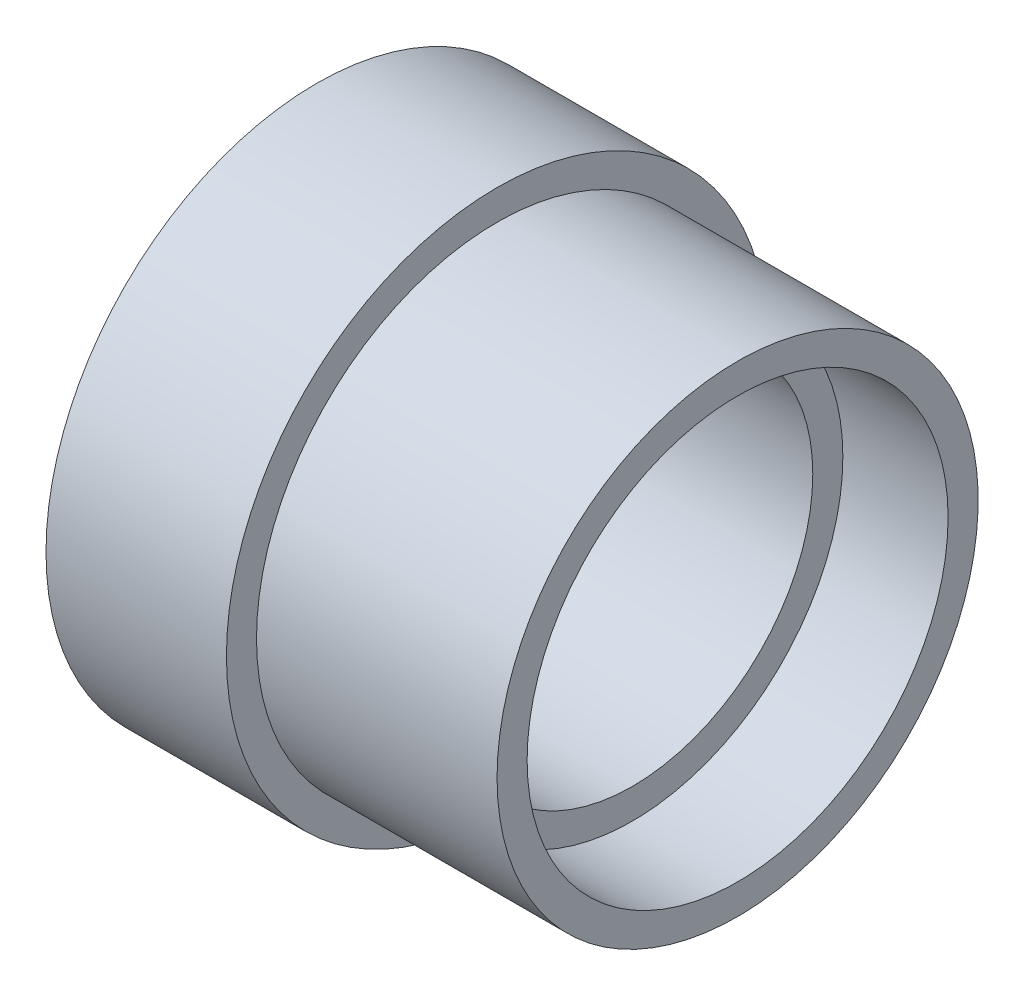
ISO-10303-21;
HEADER;
FILE_DESCRIPTION(('STEP AP214'),'2;1');
FILE_NAME('part.step','',(''),(''),'','','');
FILE_SCHEMA(('AUTOMOTIVE_DESIGN { 1 0 10303 214 1 1 1 1 }'));
ENDSEC;
DATA;
#1=APPLICATION_CONTEXT('core data for automotive mechanical design processes');
#2=APPLICATION_PROTOCOL_DEFINITION('international standard','automotive_design',2000,#1);
#3=PRODUCT_CONTEXT('',#1,'mechanical');
#4=PRODUCT('Part','Part','',(#3));
#5=PRODUCT_RELATED_PRODUCT_CATEGORY('part','',(#4));
#6=PRODUCT_DEFINITION_FORMATION('','',#4);
#7=PRODUCT_DEFINITION_CONTEXT('part definition',#1,'design');
#8=PRODUCT_DEFINITION('design','',#6,#7);
#9=PRODUCT_DEFINITION_SHAPE('','',#8);
#10=(LENGTH_UNIT() NAMED_UNIT(*) SI_UNIT(.MILLI.,.METRE.));
#11=(NAMED_UNIT(*) PLANE_ANGLE_UNIT() SI_UNIT($,.RADIAN.));
#12=(NAMED_UNIT(*) SI_UNIT($,.STERADIAN.) SOLID_ANGLE_UNIT());
#13=UNCERTAINTY_MEASURE_WITH_UNIT(LENGTH_MEASURE(1.E-05),#10,'distance_accuracy_value','');
#14=(GEOMETRIC_REPRESENTATION_CONTEXT(3) GLOBAL_UNCERTAINTY_ASSIGNED_CONTEXT((#13)) GLOBAL_UNIT_ASSIGNED_CONTEXT((#10,
#11,#12)) REPRESENTATION_CONTEXT('',''));
#15=CARTESIAN_POINT('',(0.,0.,0.));
#16=DIRECTION('',(0.,0.,1.));
#17=DIRECTION('',(1.,0.,0.));
#18=AXIS2_PLACEMENT_3D('',#15,#16,#17);
#19=CARTESIAN_POINT('',(-1017.,-156.,0.));
#20=DIRECTION('',(-1.,0.,0.));
#21=DIRECTION('',(0.,0.,1.));
#22=AXIS2_PLACEMENT_3D('',#19,#20,#21);
#23=CYLINDRICAL_SURFACE('',#22,14.);
#24=CARTESIAN_POINT('',(-2.99999999999989,-156.,0.));
#25=DIRECTION('',(-1.,0.,0.));
#26=DIRECTION('',(0.,0.,1.));
#27=AXIS2_PLACEMENT_3D('',#24,#25,#26);
#28=CIRCLE('',#27,14.);
#29=CARTESIAN_POINT('',(-2.99999999999989,-156.,14.));
#30=VERTEX_POINT('',#29);
#31=EDGE_CURVE('E10',#30,#30,#28,.T.);
#32=ORIENTED_EDGE('',*,*,#31,.F.);
#33=EDGE_LOOP('',(#32));
#34=FACE_BOUND('',#33,.T.);
#35=CARTESIAN_POINT('',(-10.,-156.,0.));
#36=DIRECTION('',(-1.,0.,0.));
#37=DIRECTION('',(0.,0.,1.));
#38=AXIS2_PLACEMENT_3D('',#35,#36,#37);
#39=CIRCLE('',#38,14.);
#40=CARTESIAN_POINT('',(-10.,-156.,14.));
#41=VERTEX_POINT('',#40);
#42=EDGE_CURVE('E66',#41,#41,#39,.T.);
#43=ORIENTED_EDGE('',*,*,#42,.T.);
#44=EDGE_LOOP('',(#43));
#45=FACE_BOUND('',#44,.T.);
#46=ADVANCED_FACE('F32',(#34,#45),#23,.F.);
#47=CARTESIAN_POINT('',(-2.99999999999997,-142.,0.));
#48=DIRECTION('',(-1.,0.,0.));
#49=DIRECTION('',(0.,0.,1.));
#50=AXIS2_PLACEMENT_3D('',#47,#48,#49);
#51=PLANE('',#50);
#52=CARTESIAN_POINT('',(-2.99999999999989,-156.,0.));
#53=DIRECTION('',(-1.,0.,0.));
#54=DIRECTION('',(0.,0.,1.));
#55=AXIS2_PLACEMENT_3D('',#52,#53,#54);
#56=CIRCLE('',#55,16.);
#57=CARTESIAN_POINT('',(-2.99999999999989,-156.,16.));
#58=VERTEX_POINT('',#57);
#59=EDGE_CURVE('E38',#58,#58,#56,.T.);
#60=ORIENTED_EDGE('',*,*,#59,.F.);
#61=EDGE_LOOP('',(#60));
#62=FACE_BOUND('',#61,.T.);
#63=ORIENTED_EDGE('',*,*,#31,.T.);
#64=EDGE_LOOP('',(#63));
#65=FACE_BOUND('',#64,.T.);
#66=ADVANCED_FACE('F115',(#62,#65),#51,.F.);
#67=CARTESIAN_POINT('',(-1017.,-156.,0.));
#68=DIRECTION('',(-1.,0.,0.));
#69=DIRECTION('',(0.,0.,1.));
#70=AXIS2_PLACEMENT_3D('',#67,#68,#69);
#71=CYLINDRICAL_SURFACE('',#70,16.);
#72=CARTESIAN_POINT('',(-18.9999999999999,-156.,0.));
#73=DIRECTION('',(-1.,0.,0.));
#74=DIRECTION('',(0.,0.,1.));
#75=AXIS2_PLACEMENT_3D('',#72,#73,#74);
#76=CIRCLE('',#75,16.);
#77=CARTESIAN_POINT('',(-18.9999999999999,-156.,16.));
#78=VERTEX_POINT('',#77);
#79=EDGE_CURVE('E42',#78,#78,#76,.T.);
#80=ORIENTED_EDGE('',*,*,#79,.F.);
#81=EDGE_LOOP('',(#80));
#82=FACE_BOUND('',#81,.T.);
#83=ORIENTED_EDGE('',*,*,#59,.T.);
#84=EDGE_LOOP('',(#83));
#85=FACE_BOUND('',#84,.T.);
#86=ADVANCED_FACE('F110',(#82,#85),#71,.T.);
#87=CARTESIAN_POINT('',(-19.,-140.,0.));
#88=DIRECTION('',(-1.,0.,0.));
#89=DIRECTION('',(0.,0.,1.));
#90=AXIS2_PLACEMENT_3D('',#87,#88,#89);
#91=PLANE('',#90);
#92=CARTESIAN_POINT('',(-18.9999999999999,-156.,0.));
#93=DIRECTION('',(-1.,0.,0.));
#94=DIRECTION('',(0.,0.,1.));
#95=AXIS2_PLACEMENT_3D('',#92,#93,#94);
#96=CIRCLE('',#95,18.);
#97=CARTESIAN_POINT('',(-18.9999999999999,-156.,18.));
#98=VERTEX_POINT('',#97);
#99=EDGE_CURVE('E46',#98,#98,#96,.T.);
#100=ORIENTED_EDGE('',*,*,#99,.F.);
#101=EDGE_LOOP('',(#100));
#102=FACE_BOUND('',#101,.T.);
#103=ORIENTED_EDGE('',*,*,#79,.T.);
#104=EDGE_LOOP('',(#103));
#105=FACE_BOUND('',#104,.T.);
#106=ADVANCED_FACE('F104',(#102,#105),#91,.F.);
#107=CARTESIAN_POINT('',(-1017.,-156.,0.));
#108=DIRECTION('',(-1.,0.,0.));
#109=DIRECTION('',(0.,0.,1.));
#110=AXIS2_PLACEMENT_3D('',#107,#108,#109);
#111=CYLINDRICAL_SURFACE('',#110,18.);
#112=CARTESIAN_POINT('',(-30.9999999999999,-156.,0.));
#113=DIRECTION('',(-1.,0.,0.));
#114=DIRECTION('',(0.,0.,1.));
#115=AXIS2_PLACEMENT_3D('',#112,#113,#114);
#116=CIRCLE('',#115,18.);
#117=CARTESIAN_POINT('',(-30.9999999999999,-156.,18.));
#118=VERTEX_POINT('',#117);
#119=EDGE_CURVE('E51',#118,#118,#116,.T.);
#120=ORIENTED_EDGE('',*,*,#119,.F.);
#121=EDGE_LOOP('',(#120));
#122=FACE_BOUND('',#121,.T.);
#123=ORIENTED_EDGE('',*,*,#99,.T.);
#124=EDGE_LOOP('',(#123));
#125=FACE_BOUND('',#124,.T.);
#126=ADVANCED_FACE('F98',(#122,#125),#111,.T.);
#127=CARTESIAN_POINT('',(-31.,-138.,0.));
#128=DIRECTION('',(1.,0.,0.));
#129=DIRECTION('',(0.,0.,-1.));
#130=AXIS2_PLACEMENT_3D('',#127,#128,#129);
#131=PLANE('',#130);
#132=CARTESIAN_POINT('',(-30.9999999999999,-156.,0.));
#133=DIRECTION('',(-1.,0.,0.));
#134=DIRECTION('',(0.,0.,1.));
#135=AXIS2_PLACEMENT_3D('',#132,#133,#134);
#136=CIRCLE('',#135,14.);
#137=CARTESIAN_POINT('',(-30.9999999999999,-156.,14.));
#138=VERTEX_POINT('',#137);
#139=EDGE_CURVE('E54',#138,#138,#136,.T.);
#140=ORIENTED_EDGE('',*,*,#139,.F.);
#141=EDGE_LOOP('',(#140));
#142=FACE_BOUND('',#141,.T.);
#143=ORIENTED_EDGE('',*,*,#119,.T.);
#144=EDGE_LOOP('',(#143));
#145=FACE_BOUND('',#144,.T.);
#146=ADVANCED_FACE('F92',(#142,#145),#131,.F.);
#147=CARTESIAN_POINT('',(-1017.,-156.,0.));
#148=DIRECTION('',(-1.,0.,0.));
#149=DIRECTION('',(0.,0.,1.));
#150=AXIS2_PLACEMENT_3D('',#147,#148,#149);
#151=CYLINDRICAL_SURFACE('',#150,14.);
#152=CARTESIAN_POINT('',(-24.,-156.,0.));
#153=DIRECTION('',(-1.,0.,0.));
#154=DIRECTION('',(0.,0.,1.));
#155=AXIS2_PLACEMENT_3D('',#152,#153,#154);
#156=CIRCLE('',#155,14.);
#157=CARTESIAN_POINT('',(-24.,-156.,14.));
#158=VERTEX_POINT('',#157);
#159=EDGE_CURVE('E57',#158,#158,#156,.T.);
#160=ORIENTED_EDGE('',*,*,#159,.F.);
#161=EDGE_LOOP('',(#160));
#162=FACE_BOUND('',#161,.T.);
#163=ORIENTED_EDGE('',*,*,#139,.T.);
#164=EDGE_LOOP('',(#163));
#165=FACE_BOUND('',#164,.T.);
#166=ADVANCED_FACE('F86',(#162,#165),#151,.F.);
#167=CARTESIAN_POINT('',(-24.,-142.,0.));
#168=DIRECTION('',(1.,0.,0.));
#169=DIRECTION('',(0.,0.,-1.));
#170=AXIS2_PLACEMENT_3D('',#167,#168,#169);
#171=PLANE('',#170);
#172=CARTESIAN_POINT('',(-24.,-156.,0.));
#173=DIRECTION('',(-1.,0.,0.));
#174=DIRECTION('',(0.,0.,1.));
#175=AXIS2_PLACEMENT_3D('',#172,#173,#174);
#176=CIRCLE('',#175,12.);
#177=CARTESIAN_POINT('',(-24.,-156.,12.));
#178=VERTEX_POINT('',#177);
#179=EDGE_CURVE('E60',#178,#178,#176,.T.);
#180=ORIENTED_EDGE('',*,*,#179,.F.);
#181=EDGE_LOOP('',(#180));
#182=FACE_BOUND('',#181,.T.);
#183=ORIENTED_EDGE('',*,*,#159,.T.);
#184=EDGE_LOOP('',(#183));
#185=FACE_BOUND('',#184,.T.);
#186=ADVANCED_FACE('F80',(#182,#185),#171,.F.);
#187=CARTESIAN_POINT('',(-1017.,-156.,0.));
#188=DIRECTION('',(-1.,0.,0.));
#189=DIRECTION('',(0.,0.,1.));
#190=AXIS2_PLACEMENT_3D('',#187,#188,#189);
#191=CYLINDRICAL_SURFACE('',#190,12.);
#192=CARTESIAN_POINT('',(-10.,-156.,0.));
#193=DIRECTION('',(-1.,0.,0.));
#194=DIRECTION('',(0.,0.,1.));
#195=AXIS2_PLACEMENT_3D('',#192,#193,#194);
#196=CIRCLE('',#195,12.);
#197=CARTESIAN_POINT('',(-10.,-156.,12.));
#198=VERTEX_POINT('',#197);
#199=EDGE_CURVE('E63',#198,#198,#196,.T.);
#200=ORIENTED_EDGE('',*,*,#199,.F.);
#201=EDGE_LOOP('',(#200));
#202=FACE_BOUND('',#201,.T.);
#203=ORIENTED_EDGE('',*,*,#179,.T.);
#204=EDGE_LOOP('',(#203));
#205=FACE_BOUND('',#204,.T.);
#206=ADVANCED_FACE('F74',(#202,#205),#191,.F.);
#207=CARTESIAN_POINT('',(-9.99999999999996,-144.,0.));
#208=DIRECTION('',(-1.,0.,0.));
#209=DIRECTION('',(0.,0.,1.));
#210=AXIS2_PLACEMENT_3D('',#207,#208,#209);
#211=PLANE('',#210);
#212=ORIENTED_EDGE('',*,*,#42,.F.);
#213=EDGE_LOOP('',(#212));
#214=FACE_BOUND('',#213,.T.);
#215=ORIENTED_EDGE('',*,*,#199,.T.);
#216=EDGE_LOOP('',(#215));
#217=FACE_BOUND('',#216,.T.);
#218=ADVANCED_FACE('F71',(#214,#217),#211,.F.);
#219=CLOSED_SHELL('',(#46,#66,#86,#106,#126,#146,#166,#186,#206,#218));
#220=MANIFOLD_SOLID_BREP('B2',#219);
#221=ADVANCED_BREP_SHAPE_REPRESENTATION('',(#18,#220),#14);
#222=SHAPE_DEFINITION_REPRESENTATION(#9,#221);
ENDSEC;
END-ISO-10303-21;
